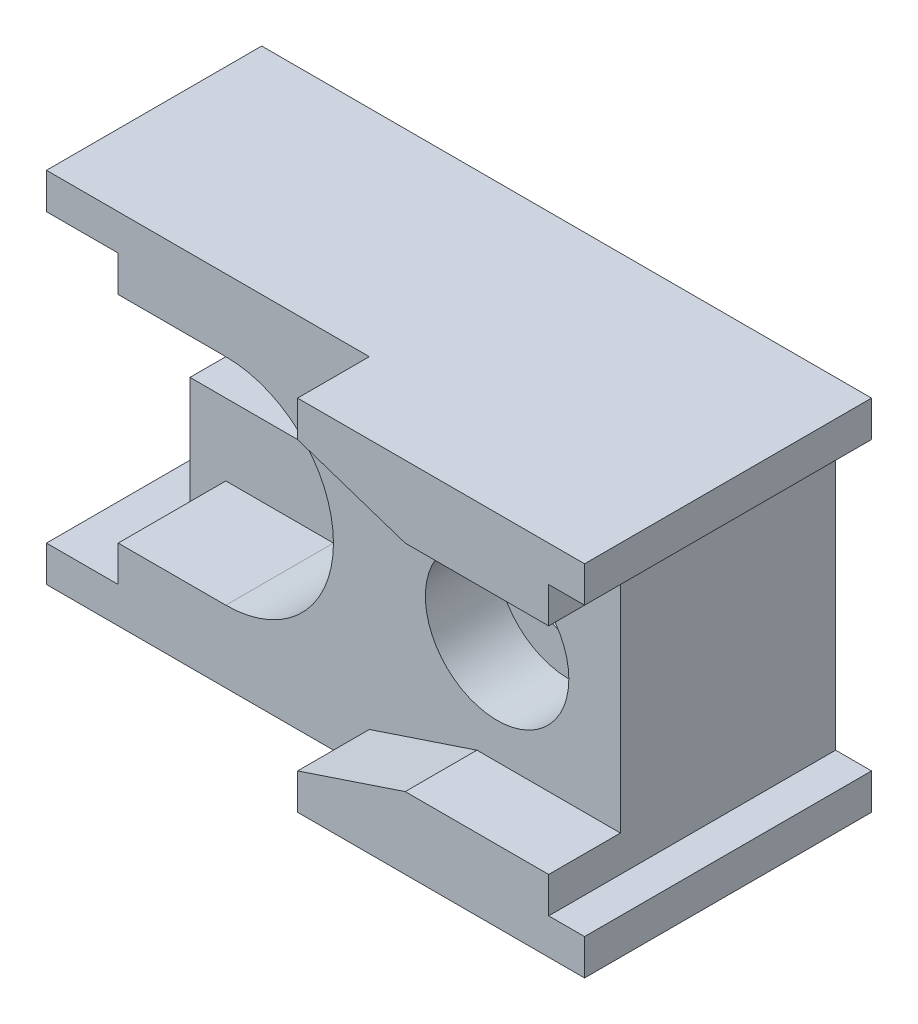
ISO-10303-21;
HEADER;
FILE_DESCRIPTION(('STEP AP214'),'2;1');
FILE_NAME('part.step','',(''),(''),'','','');
FILE_SCHEMA(('AUTOMOTIVE_DESIGN { 1 0 10303 214 1 1 1 1 }'));
ENDSEC;
DATA;
#1=APPLICATION_CONTEXT('core data for automotive mechanical design processes');
#2=APPLICATION_PROTOCOL_DEFINITION('international standard','automotive_design',2000,#1);
#3=PRODUCT_CONTEXT('',#1,'mechanical');
#4=PRODUCT('Part','Part','',(#3));
#5=PRODUCT_RELATED_PRODUCT_CATEGORY('part','',(#4));
#6=PRODUCT_DEFINITION_FORMATION('','',#4);
#7=PRODUCT_DEFINITION_CONTEXT('part definition',#1,'design');
#8=PRODUCT_DEFINITION('design','',#6,#7);
#9=PRODUCT_DEFINITION_SHAPE('','',#8);
#10=(LENGTH_UNIT() NAMED_UNIT(*) SI_UNIT(.MILLI.,.METRE.));
#11=(NAMED_UNIT(*) PLANE_ANGLE_UNIT() SI_UNIT($,.RADIAN.));
#12=(NAMED_UNIT(*) SI_UNIT($,.STERADIAN.) SOLID_ANGLE_UNIT());
#13=UNCERTAINTY_MEASURE_WITH_UNIT(LENGTH_MEASURE(1.E-05),#10,'distance_accuracy_value','');
#14=(GEOMETRIC_REPRESENTATION_CONTEXT(3) GLOBAL_UNCERTAINTY_ASSIGNED_CONTEXT((#13)) GLOBAL_UNIT_ASSIGNED_CONTEXT((#10,
#11,#12)) REPRESENTATION_CONTEXT('',''));
#15=CARTESIAN_POINT('',(0.,0.,0.));
#16=DIRECTION('',(0.,0.,1.));
#17=DIRECTION('',(1.,0.,0.));
#18=AXIS2_PLACEMENT_3D('',#15,#16,#17);
#19=CARTESIAN_POINT('',(-7.5,4.,8.));
#20=DIRECTION('',(1.,0.,0.));
#21=DIRECTION('',(0.,1.,0.));
#22=AXIS2_PLACEMENT_3D('',#19,#20,#21);
#23=PLANE('',#22);
#24=DIRECTION('',(0.,-1.,0.));
#25=VECTOR('',#24,1.);
#26=CARTESIAN_POINT('',(-7.5,0.,3.));
#27=LINE('',#26,#25);
#28=CARTESIAN_POINT('',(-7.5,4.,3.));
#29=VERTEX_POINT('',#28);
#30=CARTESIAN_POINT('',(-7.5,1.,3.));
#31=VERTEX_POINT('',#30);
#32=EDGE_CURVE('E260',#29,#31,#27,.T.);
#33=ORIENTED_EDGE('',*,*,#32,.F.);
#34=DIRECTION('',(0.,0.,-1.));
#35=VECTOR('',#34,1.);
#36=CARTESIAN_POINT('',(-7.5,4.,8.));
#37=LINE('',#36,#35);
#38=CARTESIAN_POINT('',(-7.5,4.,0.));
#39=VERTEX_POINT('',#38);
#40=EDGE_CURVE('E231',#29,#39,#37,.T.);
#41=ORIENTED_EDGE('',*,*,#40,.T.);
#42=DIRECTION('',(0.,-1.,0.));
#43=VECTOR('',#42,1.);
#44=CARTESIAN_POINT('',(-7.5,4.,0.));
#45=LINE('',#44,#43);
#46=CARTESIAN_POINT('',(-7.5,1.,0.));
#47=VERTEX_POINT('',#46);
#48=EDGE_CURVE('E176',#39,#47,#45,.T.);
#49=ORIENTED_EDGE('',*,*,#48,.T.);
#50=DIRECTION('',(0.,0.,-1.));
#51=VECTOR('',#50,1.);
#52=CARTESIAN_POINT('',(-7.5,1.,8.));
#53=LINE('',#52,#51);
#54=EDGE_CURVE('E229',#31,#47,#53,.T.);
#55=ORIENTED_EDGE('',*,*,#54,.F.);
#56=EDGE_LOOP('',(#33,#41,#49,#55));
#57=FACE_BOUND('',#56,.T.);
#58=ADVANCED_FACE('F33',(#57),#23,.F.);
#59=CARTESIAN_POINT('',(-7.5,1.,8.));
#60=DIRECTION('',(0.,1.,0.));
#61=DIRECTION('',(-1.,0.,0.));
#62=AXIS2_PLACEMENT_3D('',#59,#60,#61);
#63=PLANE('',#62);
#64=DIRECTION('',(1.,0.,0.));
#65=VECTOR('',#64,1.);
#66=CARTESIAN_POINT('',(-7.5,1.,3.));
#67=LINE('',#66,#65);
#68=CARTESIAN_POINT('',(-3.5,0.999999999999999,3.));
#69=VERTEX_POINT('',#68);
#70=EDGE_CURVE('E514',#31,#69,#67,.T.);
#71=ORIENTED_EDGE('',*,*,#70,.F.);
#72=ORIENTED_EDGE('',*,*,#54,.T.);
#73=DIRECTION('',(1.,0.,0.));
#74=VECTOR('',#73,1.);
#75=CARTESIAN_POINT('',(-7.5,1.,0.));
#76=LINE('',#75,#74);
#77=CARTESIAN_POINT('',(-3.5,0.999999999999999,0.));
#78=VERTEX_POINT('',#77);
#79=EDGE_CURVE('E179',#47,#78,#76,.T.);
#80=ORIENTED_EDGE('',*,*,#79,.T.);
#81=DIRECTION('',(0.,0.,-1.));
#82=VECTOR('',#81,1.);
#83=CARTESIAN_POINT('',(-3.5,0.999999999999999,8.));
#84=LINE('',#83,#82);
#85=EDGE_CURVE('E227',#69,#78,#84,.T.);
#86=ORIENTED_EDGE('',*,*,#85,.F.);
#87=EDGE_LOOP('',(#71,#72,#80,#86));
#88=FACE_BOUND('',#87,.T.);
#89=ADVANCED_FACE('F477',(#88),#63,.F.);
#90=CARTESIAN_POINT('',(-3.5,0.,8.));
#91=DIRECTION('',(0.,0.,-1.));
#92=DIRECTION('',(-1.,0.,0.));
#93=AXIS2_PLACEMENT_3D('',#90,#91,#92);
#94=CYLINDRICAL_SURFACE('',#93,0.999999999999999);
#95=CARTESIAN_POINT('',(-3.5,0.,3.));
#96=DIRECTION('',(0.,0.,1.));
#97=DIRECTION('',(1.,0.,0.));
#98=AXIS2_PLACEMENT_3D('',#95,#96,#97);
#99=CIRCLE('',#98,0.999999999999999);
#100=CARTESIAN_POINT('',(-3.5,-0.999999999999999,3.));
#101=VERTEX_POINT('',#100);
#102=EDGE_CURVE('E510',#69,#101,#99,.F.);
#103=ORIENTED_EDGE('',*,*,#102,.F.);
#104=ORIENTED_EDGE('',*,*,#85,.T.);
#105=CARTESIAN_POINT('',(-3.5,0.,0.));
#106=DIRECTION('',(0.,0.,-1.));
#107=DIRECTION('',(1.,0.,0.));
#108=AXIS2_PLACEMENT_3D('',#105,#106,#107);
#109=CIRCLE('',#108,0.999999999999999);
#110=CARTESIAN_POINT('',(-3.5,-0.999999999999999,0.));
#111=VERTEX_POINT('',#110);
#112=EDGE_CURVE('E182',#78,#111,#109,.T.);
#113=ORIENTED_EDGE('',*,*,#112,.T.);
#114=DIRECTION('',(0.,0.,-1.));
#115=VECTOR('',#114,1.);
#116=CARTESIAN_POINT('',(-3.5,-0.999999999999999,8.));
#117=LINE('',#116,#115);
#118=EDGE_CURVE('E225',#101,#111,#117,.T.);
#119=ORIENTED_EDGE('',*,*,#118,.F.);
#120=EDGE_LOOP('',(#103,#104,#113,#119));
#121=FACE_BOUND('',#120,.T.);
#122=ADVANCED_FACE('F482',(#121),#94,.F.);
#123=CARTESIAN_POINT('',(-7.5,-1.,8.));
#124=DIRECTION('',(0.,-1.,0.));
#125=DIRECTION('',(1.,0.,0.));
#126=AXIS2_PLACEMENT_3D('',#123,#124,#125);
#127=PLANE('',#126);
#128=DIRECTION('',(-1.,0.,0.));
#129=VECTOR('',#128,1.);
#130=CARTESIAN_POINT('',(-7.5,-1.,3.));
#131=LINE('',#130,#129);
#132=CARTESIAN_POINT('',(-7.5,-1.,3.));
#133=VERTEX_POINT('',#132);
#134=EDGE_CURVE('E515',#101,#133,#131,.T.);
#135=ORIENTED_EDGE('',*,*,#134,.F.);
#136=ORIENTED_EDGE('',*,*,#118,.T.);
#137=DIRECTION('',(-1.,0.,0.));
#138=VECTOR('',#137,1.);
#139=CARTESIAN_POINT('',(-7.5,-1.,0.));
#140=LINE('',#139,#138);
#141=CARTESIAN_POINT('',(-7.5,-1.,0.));
#142=VERTEX_POINT('',#141);
#143=EDGE_CURVE('E185',#111,#142,#140,.T.);
#144=ORIENTED_EDGE('',*,*,#143,.T.);
#145=DIRECTION('',(0.,0.,-1.));
#146=VECTOR('',#145,1.);
#147=CARTESIAN_POINT('',(-7.5,-1.,8.));
#148=LINE('',#147,#146);
#149=EDGE_CURVE('E223',#133,#142,#148,.T.);
#150=ORIENTED_EDGE('',*,*,#149,.F.);
#151=EDGE_LOOP('',(#135,#136,#144,#150));
#152=FACE_BOUND('',#151,.T.);
#153=ADVANCED_FACE('F494',(#152),#127,.F.);
#154=CARTESIAN_POINT('',(-7.5,-1.,8.));
#155=DIRECTION('',(1.,0.,0.));
#156=DIRECTION('',(0.,0.,-1.));
#157=AXIS2_PLACEMENT_3D('',#154,#155,#156);
#158=PLANE('',#157);
#159=DIRECTION('',(0.,-1.,0.));
#160=VECTOR('',#159,1.);
#161=CARTESIAN_POINT('',(-7.5,0.,3.));
#162=LINE('',#161,#160);
#163=CARTESIAN_POINT('',(-7.5,-4.,3.));
#164=VERTEX_POINT('',#163);
#165=EDGE_CURVE('E740',#133,#164,#162,.T.);
#166=ORIENTED_EDGE('',*,*,#165,.F.);
#167=ORIENTED_EDGE('',*,*,#149,.T.);
#168=DIRECTION('',(0.,-1.,0.));
#169=VECTOR('',#168,1.);
#170=CARTESIAN_POINT('',(-7.5,-1.,0.));
#171=LINE('',#170,#169);
#172=CARTESIAN_POINT('',(-7.5,-4.,0.));
#173=VERTEX_POINT('',#172);
#174=EDGE_CURVE('E188',#142,#173,#171,.T.);
#175=ORIENTED_EDGE('',*,*,#174,.T.);
#176=DIRECTION('',(0.,0.,-1.));
#177=VECTOR('',#176,1.);
#178=CARTESIAN_POINT('',(-7.5,-4.,8.));
#179=LINE('',#178,#177);
#180=EDGE_CURVE('E221',#164,#173,#179,.T.);
#181=ORIENTED_EDGE('',*,*,#180,.F.);
#182=EDGE_LOOP('',(#166,#167,#175,#181));
#183=FACE_BOUND('',#182,.T.);
#184=ADVANCED_FACE('F490',(#183),#158,.F.);
#185=CARTESIAN_POINT('',(-8.5,4.,8.));
#186=DIRECTION('',(1.,0.,0.));
#187=DIRECTION('',(0.,0.,-1.));
#188=AXIS2_PLACEMENT_3D('',#185,#186,#187);
#189=PLANE('',#188);
#190=DIRECTION('',(0.,-1.,0.));
#191=VECTOR('',#190,1.);
#192=CARTESIAN_POINT('',(-8.5,0.,6.));
#193=LINE('',#192,#191);
#194=CARTESIAN_POINT('',(-8.5,5.,6.));
#195=VERTEX_POINT('',#194);
#196=CARTESIAN_POINT('',(-8.5,4.,6.));
#197=VERTEX_POINT('',#196);
#198=EDGE_CURVE('E433',#195,#197,#193,.T.);
#199=ORIENTED_EDGE('',*,*,#198,.F.);
#200=DIRECTION('',(0.,0.,-1.));
#201=VECTOR('',#200,1.);
#202=CARTESIAN_POINT('',(-8.5,5.,8.));
#203=LINE('',#202,#201);
#204=CARTESIAN_POINT('',(-8.5,5.,0.));
#205=VERTEX_POINT('',#204);
#206=EDGE_CURVE('E11',#195,#205,#203,.T.);
#207=ORIENTED_EDGE('',*,*,#206,.T.);
#208=DIRECTION('',(0.,-1.,0.));
#209=VECTOR('',#208,1.);
#210=CARTESIAN_POINT('',(-8.5,4.,0.));
#211=LINE('',#210,#209);
#212=CARTESIAN_POINT('',(-8.5,4.,0.));
#213=VERTEX_POINT('',#212);
#214=EDGE_CURVE('E169',#205,#213,#211,.T.);
#215=ORIENTED_EDGE('',*,*,#214,.T.);
#216=DIRECTION('',(0.,0.,-1.));
#217=VECTOR('',#216,1.);
#218=CARTESIAN_POINT('',(-8.5,4.,8.));
#219=LINE('',#218,#217);
#220=EDGE_CURVE('E42',#197,#213,#219,.T.);
#221=ORIENTED_EDGE('',*,*,#220,.F.);
#222=EDGE_LOOP('',(#199,#207,#215,#221));
#223=FACE_BOUND('',#222,.T.);
#224=ADVANCED_FACE('F247',(#223),#189,.F.);
#225=CARTESIAN_POINT('',(-8.5,4.,8.));
#226=DIRECTION('',(0.,1.,0.));
#227=DIRECTION('',(0.,0.,1.));
#228=AXIS2_PLACEMENT_3D('',#225,#226,#227);
#229=PLANE('',#228);
#230=DIRECTION('',(1.,0.,0.));
#231=VECTOR('',#230,1.);
#232=CARTESIAN_POINT('',(0.,4.,6.));
#233=LINE('',#232,#231);
#234=CARTESIAN_POINT('',(-6.5,4.,6.));
#235=VERTEX_POINT('',#234);
#236=EDGE_CURVE('E243',#197,#235,#233,.T.);
#237=ORIENTED_EDGE('',*,*,#236,.F.);
#238=ORIENTED_EDGE('',*,*,#220,.T.);
#239=DIRECTION('',(1.,0.,0.));
#240=VECTOR('',#239,1.);
#241=CARTESIAN_POINT('',(-8.5,4.,0.));
#242=LINE('',#241,#240);
#243=EDGE_CURVE('E173',#213,#39,#242,.T.);
#244=ORIENTED_EDGE('',*,*,#243,.T.);
#245=ORIENTED_EDGE('',*,*,#40,.F.);
#246=DIRECTION('',(-1.,0.,0.));
#247=VECTOR('',#246,1.);
#248=CARTESIAN_POINT('',(0.,4.,3.));
#249=LINE('',#248,#247);
#250=CARTESIAN_POINT('',(-6.5,4.,3.));
#251=VERTEX_POINT('',#250);
#252=EDGE_CURVE('E264',#251,#29,#249,.T.);
#253=ORIENTED_EDGE('',*,*,#252,.F.);
#254=DIRECTION('',(0.,0.,1.));
#255=VECTOR('',#254,1.);
#256=CARTESIAN_POINT('',(-6.5,4.,3.));
#257=LINE('',#256,#255);
#258=EDGE_CURVE('E523',#251,#235,#257,.T.);
#259=ORIENTED_EDGE('',*,*,#258,.T.);
#260=EDGE_LOOP('',(#237,#238,#244,#245,#253,#259));
#261=FACE_BOUND('',#260,.T.);
#262=ADVANCED_FACE('F236',(#261),#229,.F.);
#263=CARTESIAN_POINT('',(-8.5,-4.,8.));
#264=DIRECTION('',(0.,-1.,0.));
#265=DIRECTION('',(0.,0.,-1.));
#266=AXIS2_PLACEMENT_3D('',#263,#264,#265);
#267=PLANE('',#266);
#268=DIRECTION('',(-1.,0.,0.));
#269=VECTOR('',#268,1.);
#270=CARTESIAN_POINT('',(0.,-4.,6.));
#271=LINE('',#270,#269);
#272=CARTESIAN_POINT('',(-6.5,-4.,6.));
#273=VERTEX_POINT('',#272);
#274=CARTESIAN_POINT('',(-8.5,-4.,6.));
#275=VERTEX_POINT('',#274);
#276=EDGE_CURVE('E436',#273,#275,#271,.T.);
#277=ORIENTED_EDGE('',*,*,#276,.F.);
#278=DIRECTION('',(0.,0.,1.));
#279=VECTOR('',#278,1.);
#280=CARTESIAN_POINT('',(-6.5,-4.,3.));
#281=LINE('',#280,#279);
#282=CARTESIAN_POINT('',(-6.5,-4.,3.));
#283=VERTEX_POINT('',#282);
#284=EDGE_CURVE('E528',#283,#273,#281,.T.);
#285=ORIENTED_EDGE('',*,*,#284,.F.);
#286=DIRECTION('',(1.,0.,0.));
#287=VECTOR('',#286,1.);
#288=CARTESIAN_POINT('',(0.,-4.,3.));
#289=LINE('',#288,#287);
#290=EDGE_CURVE('E762',#164,#283,#289,.T.);
#291=ORIENTED_EDGE('',*,*,#290,.F.);
#292=ORIENTED_EDGE('',*,*,#180,.T.);
#293=DIRECTION('',(-1.,0.,0.));
#294=VECTOR('',#293,1.);
#295=CARTESIAN_POINT('',(-8.5,-4.,0.));
#296=LINE('',#295,#294);
#297=CARTESIAN_POINT('',(-8.5,-4.,0.));
#298=VERTEX_POINT('',#297);
#299=EDGE_CURVE('E191',#173,#298,#296,.T.);
#300=ORIENTED_EDGE('',*,*,#299,.T.);
#301=DIRECTION('',(0.,0.,-1.));
#302=VECTOR('',#301,1.);
#303=CARTESIAN_POINT('',(-8.5,-4.,8.));
#304=LINE('',#303,#302);
#305=EDGE_CURVE('E219',#275,#298,#304,.T.);
#306=ORIENTED_EDGE('',*,*,#305,.F.);
#307=EDGE_LOOP('',(#277,#285,#291,#292,#300,#306));
#308=FACE_BOUND('',#307,.T.);
#309=ADVANCED_FACE('F488',(#308),#267,.F.);
#310=CARTESIAN_POINT('',(-8.5,-5.,8.));
#311=DIRECTION('',(1.,0.,0.));
#312=DIRECTION('',(0.,0.,-1.));
#313=AXIS2_PLACEMENT_3D('',#310,#311,#312);
#314=PLANE('',#313);
#315=DIRECTION('',(0.,-1.,0.));
#316=VECTOR('',#315,1.);
#317=CARTESIAN_POINT('',(-8.5,0.,6.));
#318=LINE('',#317,#316);
#319=CARTESIAN_POINT('',(-8.5,-5.,6.));
#320=VERTEX_POINT('',#319);
#321=EDGE_CURVE('E438',#275,#320,#318,.T.);
#322=ORIENTED_EDGE('',*,*,#321,.F.);
#323=ORIENTED_EDGE('',*,*,#305,.T.);
#324=DIRECTION('',(0.,-1.,0.));
#325=VECTOR('',#324,1.);
#326=CARTESIAN_POINT('',(-8.5,-5.,0.));
#327=LINE('',#326,#325);
#328=CARTESIAN_POINT('',(-8.5,-5.,0.));
#329=VERTEX_POINT('',#328);
#330=EDGE_CURVE('E194',#298,#329,#327,.T.);
#331=ORIENTED_EDGE('',*,*,#330,.T.);
#332=DIRECTION('',(0.,0.,-1.));
#333=VECTOR('',#332,1.);
#334=CARTESIAN_POINT('',(-8.5,-5.,8.));
#335=LINE('',#334,#333);
#336=EDGE_CURVE('E217',#320,#329,#335,.T.);
#337=ORIENTED_EDGE('',*,*,#336,.F.);
#338=EDGE_LOOP('',(#322,#323,#331,#337));
#339=FACE_BOUND('',#338,.T.);
#340=ADVANCED_FACE('F644',(#339),#314,.F.);
#341=CARTESIAN_POINT('',(-8.5,-5.,8.));
#342=DIRECTION('',(0.,1.,0.));
#343=DIRECTION('',(0.,0.,1.));
#344=AXIS2_PLACEMENT_3D('',#341,#342,#343);
#345=PLANE('',#344);
#346=DIRECTION('',(0.,0.,1.));
#347=VECTOR('',#346,1.);
#348=CARTESIAN_POINT('',(0.500000000000001,-5.,6.));
#349=LINE('',#348,#347);
#350=CARTESIAN_POINT('',(0.500000000000001,-5.,6.));
#351=VERTEX_POINT('',#350);
#352=CARTESIAN_POINT('',(0.500000000000001,-5.,8.));
#353=VERTEX_POINT('',#352);
#354=EDGE_CURVE('E389',#351,#353,#349,.T.);
#355=ORIENTED_EDGE('',*,*,#354,.F.);
#356=DIRECTION('',(1.,0.,0.));
#357=VECTOR('',#356,1.);
#358=CARTESIAN_POINT('',(0.,-5.,6.));
#359=LINE('',#358,#357);
#360=EDGE_CURVE('E440',#320,#351,#359,.T.);
#361=ORIENTED_EDGE('',*,*,#360,.F.);
#362=ORIENTED_EDGE('',*,*,#336,.T.);
#363=DIRECTION('',(1.,0.,0.));
#364=VECTOR('',#363,1.);
#365=CARTESIAN_POINT('',(-8.5,-5.,0.));
#366=LINE('',#365,#364);
#367=CARTESIAN_POINT('',(8.5,-5.,0.));
#368=VERTEX_POINT('',#367);
#369=EDGE_CURVE('E197',#329,#368,#366,.T.);
#370=ORIENTED_EDGE('',*,*,#369,.T.);
#371=DIRECTION('',(0.,0.,-1.));
#372=VECTOR('',#371,1.);
#373=CARTESIAN_POINT('',(8.5,-5.,8.));
#374=LINE('',#373,#372);
#375=CARTESIAN_POINT('',(8.5,-5.,8.));
#376=VERTEX_POINT('',#375);
#377=EDGE_CURVE('E214',#376,#368,#374,.T.);
#378=ORIENTED_EDGE('',*,*,#377,.F.);
#379=DIRECTION('',(1.,0.,0.));
#380=VECTOR('',#379,1.);
#381=CARTESIAN_POINT('',(-8.5,-5.,8.));
#382=LINE('',#381,#380);
#383=EDGE_CURVE('E123',#353,#376,#382,.T.);
#384=ORIENTED_EDGE('',*,*,#383,.F.);
#385=EDGE_LOOP('',(#355,#361,#362,#370,#378,#384));
#386=FACE_BOUND('',#385,.T.);
#387=ADVANCED_FACE('F450',(#386),#345,.F.);
#388=CARTESIAN_POINT('',(7.5,4.,8.));
#389=DIRECTION('',(-1.,0.,0.));
#390=DIRECTION('',(0.,-1.,0.));
#391=AXIS2_PLACEMENT_3D('',#388,#389,#390);
#392=PLANE('',#391);
#393=DIRECTION('',(0.,0.,1.));
#394=VECTOR('',#393,1.);
#395=CARTESIAN_POINT('',(7.5,-3.,6.));
#396=LINE('',#395,#394);
#397=CARTESIAN_POINT('',(7.5,-3.,6.));
#398=VERTEX_POINT('',#397);
#399=CARTESIAN_POINT('',(7.5,-3.,8.));
#400=VERTEX_POINT('',#399);
#401=EDGE_CURVE('E399',#398,#400,#396,.T.);
#402=ORIENTED_EDGE('',*,*,#401,.T.);
#403=DIRECTION('',(0.,1.,0.));
#404=VECTOR('',#403,1.);
#405=CARTESIAN_POINT('',(7.5,4.,8.));
#406=LINE('',#405,#404);
#407=CARTESIAN_POINT('',(7.5,-4.,8.));
#408=VERTEX_POINT('',#407);
#409=EDGE_CURVE('E144',#408,#400,#406,.T.);
#410=ORIENTED_EDGE('',*,*,#409,.F.);
#411=DIRECTION('',(0.,0.,-1.));
#412=VECTOR('',#411,1.);
#413=CARTESIAN_POINT('',(7.5,-4.,8.));
#414=LINE('',#413,#412);
#415=CARTESIAN_POINT('',(7.5,-4.,0.));
#416=VERTEX_POINT('',#415);
#417=EDGE_CURVE('E156',#408,#416,#414,.T.);
#418=ORIENTED_EDGE('',*,*,#417,.T.);
#419=DIRECTION('',(0.,1.,0.));
#420=VECTOR('',#419,1.);
#421=CARTESIAN_POINT('',(7.5,4.,0.));
#422=LINE('',#421,#420);
#423=CARTESIAN_POINT('',(7.5,4.,0.));
#424=VERTEX_POINT('',#423);
#425=EDGE_CURVE('E153',#416,#424,#422,.T.);
#426=ORIENTED_EDGE('',*,*,#425,.T.);
#427=DIRECTION('',(0.,0.,-1.));
#428=VECTOR('',#427,1.);
#429=CARTESIAN_POINT('',(7.5,4.,8.));
#430=LINE('',#429,#428);
#431=CARTESIAN_POINT('',(7.5,4.,8.));
#432=VERTEX_POINT('',#431);
#433=EDGE_CURVE('E148',#432,#424,#430,.T.);
#434=ORIENTED_EDGE('',*,*,#433,.F.);
#435=CARTESIAN_POINT('',(7.5,3.,8.));
#436=VERTEX_POINT('',#435);
#437=EDGE_CURVE('E134',#436,#432,#406,.T.);
#438=ORIENTED_EDGE('',*,*,#437,.F.);
#439=DIRECTION('',(0.,0.,1.));
#440=VECTOR('',#439,1.);
#441=CARTESIAN_POINT('',(7.5,3.,6.));
#442=LINE('',#441,#440);
#443=CARTESIAN_POINT('',(7.5,3.,6.));
#444=VERTEX_POINT('',#443);
#445=EDGE_CURVE('E49',#444,#436,#442,.T.);
#446=ORIENTED_EDGE('',*,*,#445,.F.);
#447=DIRECTION('',(0.,1.,0.));
#448=VECTOR('',#447,1.);
#449=CARTESIAN_POINT('',(7.5,0.,6.));
#450=LINE('',#449,#448);
#451=EDGE_CURVE('E413',#398,#444,#450,.T.);
#452=ORIENTED_EDGE('',*,*,#451,.F.);
#453=EDGE_LOOP('',(#402,#410,#418,#426,#434,#438,#446,#452));
#454=FACE_BOUND('',#453,.T.);
#455=ADVANCED_FACE('F150',(#454),#392,.F.);
#456=CARTESIAN_POINT('',(-3.5,0.,8.));
#457=DIRECTION('',(0.,0.,1.));
#458=DIRECTION('',(1.,0.,0.));
#459=AXIS2_PLACEMENT_3D('',#456,#457,#458);
#460=PLANE('',#459);
#461=ORIENTED_EDGE('',*,*,#409,.T.);
#462=DIRECTION('',(-1.,0.,0.));
#463=VECTOR('',#462,1.);
#464=CARTESIAN_POINT('',(0.,-3.,8.));
#465=LINE('',#464,#463);
#466=CARTESIAN_POINT('',(3.5,-3.,8.));
#467=VERTEX_POINT('',#466);
#468=EDGE_CURVE('E367',#400,#467,#465,.T.);
#469=ORIENTED_EDGE('',*,*,#468,.T.);
#470=DIRECTION('',(-0.948683298050514,-0.316227766016838,0.));
#471=VECTOR('',#470,1.);
#472=CARTESIAN_POINT('',(1.25,-3.75,8.));
#473=LINE('',#472,#471);
#474=CARTESIAN_POINT('',(0.500000000000001,-4.,8.));
#475=VERTEX_POINT('',#474);
#476=EDGE_CURVE('E357',#467,#475,#473,.T.);
#477=ORIENTED_EDGE('',*,*,#476,.T.);
#478=DIRECTION('',(0.,-1.,0.));
#479=VECTOR('',#478,1.);
#480=CARTESIAN_POINT('',(0.500000000000001,0.,8.));
#481=LINE('',#480,#479);
#482=EDGE_CURVE('E362',#475,#353,#481,.T.);
#483=ORIENTED_EDGE('',*,*,#482,.T.);
#484=ORIENTED_EDGE('',*,*,#383,.T.);
#485=DIRECTION('',(0.,1.,0.));
#486=VECTOR('',#485,1.);
#487=CARTESIAN_POINT('',(8.5,-5.,8.));
#488=LINE('',#487,#486);
#489=CARTESIAN_POINT('',(8.5,-4.,8.));
#490=VERTEX_POINT('',#489);
#491=EDGE_CURVE('E403',#376,#490,#488,.T.);
#492=ORIENTED_EDGE('',*,*,#491,.T.);
#493=DIRECTION('',(-1.,0.,0.));
#494=VECTOR('',#493,1.);
#495=CARTESIAN_POINT('',(8.5,-4.,8.));
#496=LINE('',#495,#494);
#497=EDGE_CURVE('E145',#490,#408,#496,.T.);
#498=ORIENTED_EDGE('',*,*,#497,.T.);
#499=EDGE_LOOP('',(#461,#469,#477,#483,#484,#492,#498));
#500=FACE_BOUND('',#499,.T.);
#501=ADVANCED_FACE('F370',(#500),#460,.T.);
#502=CARTESIAN_POINT('',(-8.5,5.,8.));
#503=DIRECTION('',(0.,-1.,0.));
#504=DIRECTION('',(0.,0.,-1.));
#505=AXIS2_PLACEMENT_3D('',#502,#503,#504);
#506=PLANE('',#505);
#507=DIRECTION('',(-1.,0.,0.));
#508=VECTOR('',#507,1.);
#509=CARTESIAN_POINT('',(0.,5.,6.));
#510=LINE('',#509,#508);
#511=CARTESIAN_POINT('',(0.500000000000001,5.,6.));
#512=VERTEX_POINT('',#511);
#513=EDGE_CURVE('E431',#512,#195,#510,.T.);
#514=ORIENTED_EDGE('',*,*,#513,.F.);
#515=DIRECTION('',(0.,0.,1.));
#516=VECTOR('',#515,1.);
#517=CARTESIAN_POINT('',(0.500000000000001,5.,6.));
#518=LINE('',#517,#516);
#519=CARTESIAN_POINT('',(0.500000000000001,5.,8.));
#520=VERTEX_POINT('',#519);
#521=EDGE_CURVE('E391',#512,#520,#518,.T.);
#522=ORIENTED_EDGE('',*,*,#521,.T.);
#523=DIRECTION('',(-1.,0.,0.));
#524=VECTOR('',#523,1.);
#525=CARTESIAN_POINT('',(-8.5,5.,8.));
#526=LINE('',#525,#524);
#527=CARTESIAN_POINT('',(8.5,5.,8.));
#528=VERTEX_POINT('',#527);
#529=EDGE_CURVE('E207',#528,#520,#526,.T.);
#530=ORIENTED_EDGE('',*,*,#529,.F.);
#531=DIRECTION('',(0.,0.,-1.));
#532=VECTOR('',#531,1.);
#533=CARTESIAN_POINT('',(8.5,5.,8.));
#534=LINE('',#533,#532);
#535=CARTESIAN_POINT('',(8.5,5.,0.));
#536=VERTEX_POINT('',#535);
#537=EDGE_CURVE('E161',#528,#536,#534,.T.);
#538=ORIENTED_EDGE('',*,*,#537,.T.);
#539=DIRECTION('',(-1.,0.,0.));
#540=VECTOR('',#539,1.);
#541=CARTESIAN_POINT('',(-8.5,5.,0.));
#542=LINE('',#541,#540);
#543=EDGE_CURVE('E166',#536,#205,#542,.T.);
#544=ORIENTED_EDGE('',*,*,#543,.T.);
#545=ORIENTED_EDGE('',*,*,#206,.F.);
#546=EDGE_LOOP('',(#514,#522,#530,#538,#544,#545));
#547=FACE_BOUND('',#546,.T.);
#548=ADVANCED_FACE('F35',(#547),#506,.F.);
#549=CARTESIAN_POINT('',(8.5,-5.,8.));
#550=DIRECTION('',(-1.,0.,0.));
#551=DIRECTION('',(0.,-1.,0.));
#552=AXIS2_PLACEMENT_3D('',#549,#550,#551);
#553=PLANE('',#552);
#554=DIRECTION('',(0.,1.,0.));
#555=VECTOR('',#554,1.);
#556=CARTESIAN_POINT('',(8.5,-5.,0.));
#557=LINE('',#556,#555);
#558=CARTESIAN_POINT('',(8.5,-4.,0.));
#559=VERTEX_POINT('',#558);
#560=EDGE_CURVE('E199',#368,#559,#557,.T.);
#561=ORIENTED_EDGE('',*,*,#560,.T.);
#562=DIRECTION('',(0.,0.,-1.));
#563=VECTOR('',#562,1.);
#564=CARTESIAN_POINT('',(8.5,-4.,8.));
#565=LINE('',#564,#563);
#566=EDGE_CURVE('E211',#490,#559,#565,.T.);
#567=ORIENTED_EDGE('',*,*,#566,.F.);
#568=ORIENTED_EDGE('',*,*,#491,.F.);
#569=ORIENTED_EDGE('',*,*,#377,.T.);
#570=EDGE_LOOP('',(#561,#567,#568,#569));
#571=FACE_BOUND('',#570,.T.);
#572=ADVANCED_FACE('F454',(#571),#553,.F.);
#573=CARTESIAN_POINT('',(8.5,-4.,8.));
#574=DIRECTION('',(0.,-1.,0.));
#575=DIRECTION('',(1.,0.,0.));
#576=AXIS2_PLACEMENT_3D('',#573,#574,#575);
#577=PLANE('',#576);
#578=DIRECTION('',(-1.,0.,0.));
#579=VECTOR('',#578,1.);
#580=CARTESIAN_POINT('',(8.5,-4.,0.));
#581=LINE('',#580,#579);
#582=EDGE_CURVE('E201',#559,#416,#581,.T.);
#583=ORIENTED_EDGE('',*,*,#582,.T.);
#584=ORIENTED_EDGE('',*,*,#417,.F.);
#585=ORIENTED_EDGE('',*,*,#497,.F.);
#586=ORIENTED_EDGE('',*,*,#566,.T.);
#587=EDGE_LOOP('',(#583,#584,#585,#586));
#588=FACE_BOUND('',#587,.T.);
#589=ADVANCED_FACE('F409',(#588),#577,.F.);
#590=CARTESIAN_POINT('',(8.5,4.,8.));
#591=DIRECTION('',(0.,1.,0.));
#592=DIRECTION('',(0.,0.,1.));
#593=AXIS2_PLACEMENT_3D('',#590,#591,#592);
#594=PLANE('',#593);
#595=DIRECTION('',(1.,0.,0.));
#596=VECTOR('',#595,1.);
#597=CARTESIAN_POINT('',(8.5,4.,0.));
#598=LINE('',#597,#596);
#599=CARTESIAN_POINT('',(8.5,4.,0.));
#600=VERTEX_POINT('',#599);
#601=EDGE_CURVE('E204',#424,#600,#598,.T.);
#602=ORIENTED_EDGE('',*,*,#601,.T.);
#603=DIRECTION('',(0.,0.,-1.));
#604=VECTOR('',#603,1.);
#605=CARTESIAN_POINT('',(8.5,4.,8.));
#606=LINE('',#605,#604);
#607=CARTESIAN_POINT('',(8.5,4.,8.));
#608=VERTEX_POINT('',#607);
#609=EDGE_CURVE('E157',#608,#600,#606,.T.);
#610=ORIENTED_EDGE('',*,*,#609,.F.);
#611=DIRECTION('',(1.,0.,0.));
#612=VECTOR('',#611,1.);
#613=CARTESIAN_POINT('',(8.5,4.,8.));
#614=LINE('',#613,#612);
#615=EDGE_CURVE('E139',#432,#608,#614,.T.);
#616=ORIENTED_EDGE('',*,*,#615,.F.);
#617=ORIENTED_EDGE('',*,*,#433,.T.);
#618=EDGE_LOOP('',(#602,#610,#616,#617));
#619=FACE_BOUND('',#618,.T.);
#620=ADVANCED_FACE('F159',(#619),#594,.F.);
#621=CARTESIAN_POINT('',(8.5,4.,8.));
#622=DIRECTION('',(-1.,0.,0.));
#623=DIRECTION('',(0.,0.,1.));
#624=AXIS2_PLACEMENT_3D('',#621,#622,#623);
#625=PLANE('',#624);
#626=DIRECTION('',(0.,1.,0.));
#627=VECTOR('',#626,1.);
#628=CARTESIAN_POINT('',(8.5,4.,0.));
#629=LINE('',#628,#627);
#630=EDGE_CURVE('E114',#600,#536,#629,.T.);
#631=ORIENTED_EDGE('',*,*,#630,.T.);
#632=ORIENTED_EDGE('',*,*,#537,.F.);
#633=DIRECTION('',(0.,1.,0.));
#634=VECTOR('',#633,1.);
#635=CARTESIAN_POINT('',(8.5,4.,8.));
#636=LINE('',#635,#634);
#637=EDGE_CURVE('E58',#608,#528,#636,.T.);
#638=ORIENTED_EDGE('',*,*,#637,.F.);
#639=ORIENTED_EDGE('',*,*,#609,.T.);
#640=EDGE_LOOP('',(#631,#632,#638,#639));
#641=FACE_BOUND('',#640,.T.);
#642=ADVANCED_FACE('F455',(#641),#625,.F.);
#643=DIRECTION('',(0.,1.,0.));
#644=VECTOR('',#643,1.);
#645=CARTESIAN_POINT('',(0.500000000000001,0.,8.));
#646=LINE('',#645,#644);
#647=CARTESIAN_POINT('',(0.500000000000001,4.,8.));
#648=VERTEX_POINT('',#647);
#649=EDGE_CURVE('E385',#648,#520,#646,.T.);
#650=ORIENTED_EDGE('',*,*,#649,.F.);
#651=DIRECTION('',(-0.948683298050514,0.316227766016838,0.));
#652=VECTOR('',#651,1.);
#653=CARTESIAN_POINT('',(1.25,3.75,8.));
#654=LINE('',#653,#652);
#655=CARTESIAN_POINT('',(3.5,3.,8.));
#656=VERTEX_POINT('',#655);
#657=EDGE_CURVE('E374',#656,#648,#654,.T.);
#658=ORIENTED_EDGE('',*,*,#657,.F.);
#659=DIRECTION('',(-1.,0.,0.));
#660=VECTOR('',#659,1.);
#661=CARTESIAN_POINT('',(0.,3.,8.));
#662=LINE('',#661,#660);
#663=EDGE_CURVE('E142',#436,#656,#662,.T.);
#664=ORIENTED_EDGE('',*,*,#663,.F.);
#665=ORIENTED_EDGE('',*,*,#437,.T.);
#666=ORIENTED_EDGE('',*,*,#615,.T.);
#667=ORIENTED_EDGE('',*,*,#637,.T.);
#668=ORIENTED_EDGE('',*,*,#529,.T.);
#669=EDGE_LOOP('',(#650,#658,#664,#665,#666,#667,#668));
#670=FACE_BOUND('',#669,.T.);
#671=ADVANCED_FACE('F137',(#670),#460,.T.);
#672=CARTESIAN_POINT('',(-3.5,0.,0.));
#673=DIRECTION('',(0.,0.,1.));
#674=DIRECTION('',(1.,0.,0.));
#675=AXIS2_PLACEMENT_3D('',#672,#673,#674);
#676=PLANE('',#675);
#677=CARTESIAN_POINT('',(4.06200040100656,0.,0.));
#678=DIRECTION('',(0.,0.,1.));
#679=DIRECTION('',(1.,0.,0.));
#680=AXIS2_PLACEMENT_3D('',#677,#678,#679);
#681=CIRCLE('',#680,1.);
#682=CARTESIAN_POINT('',(5.06200040100656,0.,0.));
#683=VERTEX_POINT('',#682);
#684=EDGE_CURVE('E37',#683,#683,#681,.T.);
#685=ORIENTED_EDGE('',*,*,#684,.T.);
#686=EDGE_LOOP('',(#685));
#687=FACE_BOUND('',#686,.T.);
#688=ORIENTED_EDGE('',*,*,#543,.F.);
#689=ORIENTED_EDGE('',*,*,#630,.F.);
#690=ORIENTED_EDGE('',*,*,#601,.F.);
#691=ORIENTED_EDGE('',*,*,#425,.F.);
#692=ORIENTED_EDGE('',*,*,#582,.F.);
#693=ORIENTED_EDGE('',*,*,#560,.F.);
#694=ORIENTED_EDGE('',*,*,#369,.F.);
#695=ORIENTED_EDGE('',*,*,#330,.F.);
#696=ORIENTED_EDGE('',*,*,#299,.F.);
#697=ORIENTED_EDGE('',*,*,#174,.F.);
#698=ORIENTED_EDGE('',*,*,#143,.F.);
#699=ORIENTED_EDGE('',*,*,#112,.F.);
#700=ORIENTED_EDGE('',*,*,#79,.F.);
#701=ORIENTED_EDGE('',*,*,#48,.F.);
#702=ORIENTED_EDGE('',*,*,#243,.F.);
#703=ORIENTED_EDGE('',*,*,#214,.F.);
#704=EDGE_LOOP('',(#688,#689,#690,#691,#692,#693,#694,#695,#696,#697,#698,#699,#700,#701,#702,#703));
#705=FACE_BOUND('',#704,.T.);
#706=ADVANCED_FACE('F251',(#687,#705),#676,.F.);
#707=CARTESIAN_POINT('',(0.,-3.,6.));
#708=DIRECTION('',(0.,1.,0.));
#709=DIRECTION('',(-1.,0.,0.));
#710=AXIS2_PLACEMENT_3D('',#707,#708,#709);
#711=PLANE('',#710);
#712=ORIENTED_EDGE('',*,*,#468,.F.);
#713=ORIENTED_EDGE('',*,*,#401,.F.);
#714=DIRECTION('',(-1.,0.,0.));
#715=VECTOR('',#714,1.);
#716=CARTESIAN_POINT('',(0.,-3.,6.));
#717=LINE('',#716,#715);
#718=CARTESIAN_POINT('',(3.5,-3.,6.));
#719=VERTEX_POINT('',#718);
#720=EDGE_CURVE('E361',#398,#719,#717,.T.);
#721=ORIENTED_EDGE('',*,*,#720,.T.);
#722=DIRECTION('',(0.,0.,1.));
#723=VECTOR('',#722,1.);
#724=CARTESIAN_POINT('',(3.5,-3.,6.));
#725=LINE('',#724,#723);
#726=EDGE_CURVE('E170',#719,#467,#725,.T.);
#727=ORIENTED_EDGE('',*,*,#726,.T.);
#728=EDGE_LOOP('',(#712,#713,#721,#727));
#729=FACE_BOUND('',#728,.T.);
#730=ADVANCED_FACE('F366',(#729),#711,.T.);
#731=CARTESIAN_POINT('',(1.25,-3.75,6.));
#732=DIRECTION('',(-0.316227766016838,0.948683298050514,0.));
#733=DIRECTION('',(-0.948683298050514,-0.316227766016838,0.));
#734=AXIS2_PLACEMENT_3D('',#731,#732,#733);
#735=PLANE('',#734);
#736=ORIENTED_EDGE('',*,*,#476,.F.);
#737=ORIENTED_EDGE('',*,*,#726,.F.);
#738=DIRECTION('',(-0.948683298050514,-0.316227766016838,0.));
#739=VECTOR('',#738,1.);
#740=CARTESIAN_POINT('',(1.25,-3.75,6.));
#741=LINE('',#740,#739);
#742=CARTESIAN_POINT('',(0.500000000000001,-4.,6.));
#743=VERTEX_POINT('',#742);
#744=EDGE_CURVE('E380',#719,#743,#741,.T.);
#745=ORIENTED_EDGE('',*,*,#744,.T.);
#746=DIRECTION('',(0.,0.,1.));
#747=VECTOR('',#746,1.);
#748=CARTESIAN_POINT('',(0.500000000000001,-4.,6.));
#749=LINE('',#748,#747);
#750=EDGE_CURVE('E353',#743,#475,#749,.T.);
#751=ORIENTED_EDGE('',*,*,#750,.T.);
#752=EDGE_LOOP('',(#736,#737,#745,#751));
#753=FACE_BOUND('',#752,.T.);
#754=ADVANCED_FACE('F359',(#753),#735,.T.);
#755=CARTESIAN_POINT('',(0.500000000000001,0.,6.));
#756=DIRECTION('',(-1.,0.,0.));
#757=DIRECTION('',(0.,0.,1.));
#758=AXIS2_PLACEMENT_3D('',#755,#756,#757);
#759=PLANE('',#758);
#760=ORIENTED_EDGE('',*,*,#482,.F.);
#761=ORIENTED_EDGE('',*,*,#750,.F.);
#762=DIRECTION('',(0.,-1.,0.));
#763=VECTOR('',#762,1.);
#764=CARTESIAN_POINT('',(0.500000000000001,0.,6.));
#765=LINE('',#764,#763);
#766=EDGE_CURVE('E442',#743,#351,#765,.T.);
#767=ORIENTED_EDGE('',*,*,#766,.T.);
#768=ORIENTED_EDGE('',*,*,#354,.T.);
#769=EDGE_LOOP('',(#760,#761,#767,#768));
#770=FACE_BOUND('',#769,.T.);
#771=ADVANCED_FACE('F444',(#770),#759,.T.);
#772=CARTESIAN_POINT('',(0.500000000000001,0.,6.));
#773=DIRECTION('',(1.,0.,0.));
#774=DIRECTION('',(0.,0.,-1.));
#775=AXIS2_PLACEMENT_3D('',#772,#773,#774);
#776=PLANE('',#775);
#777=ORIENTED_EDGE('',*,*,#649,.T.);
#778=ORIENTED_EDGE('',*,*,#521,.F.);
#779=DIRECTION('',(0.,1.,0.));
#780=VECTOR('',#779,1.);
#781=CARTESIAN_POINT('',(0.500000000000001,0.,6.));
#782=LINE('',#781,#780);
#783=CARTESIAN_POINT('',(0.500000000000001,4.,6.));
#784=VERTEX_POINT('',#783);
#785=EDGE_CURVE('E428',#784,#512,#782,.T.);
#786=ORIENTED_EDGE('',*,*,#785,.F.);
#787=DIRECTION('',(0.,0.,1.));
#788=VECTOR('',#787,1.);
#789=CARTESIAN_POINT('',(0.500000000000001,4.,6.));
#790=LINE('',#789,#788);
#791=EDGE_CURVE('E394',#784,#648,#790,.T.);
#792=ORIENTED_EDGE('',*,*,#791,.T.);
#793=EDGE_LOOP('',(#777,#778,#786,#792));
#794=FACE_BOUND('',#793,.T.);
#795=ADVANCED_FACE('F460',(#794),#776,.F.);
#796=CARTESIAN_POINT('',(1.25,3.75,6.));
#797=DIRECTION('',(0.316227766016838,0.948683298050514,0.));
#798=DIRECTION('',(-0.948683298050514,0.316227766016838,0.));
#799=AXIS2_PLACEMENT_3D('',#796,#797,#798);
#800=PLANE('',#799);
#801=ORIENTED_EDGE('',*,*,#657,.T.);
#802=ORIENTED_EDGE('',*,*,#791,.F.);
#803=DIRECTION('',(-0.948683298050514,0.316227766016838,0.));
#804=VECTOR('',#803,1.);
#805=CARTESIAN_POINT('',(1.25,3.75,6.));
#806=LINE('',#805,#804);
#807=CARTESIAN_POINT('',(3.5,3.,6.));
#808=VERTEX_POINT('',#807);
#809=EDGE_CURVE('E425',#808,#784,#806,.T.);
#810=ORIENTED_EDGE('',*,*,#809,.F.);
#811=DIRECTION('',(0.,0.,1.));
#812=VECTOR('',#811,1.);
#813=CARTESIAN_POINT('',(3.5,3.,6.));
#814=LINE('',#813,#812);
#815=EDGE_CURVE('E396',#808,#656,#814,.T.);
#816=ORIENTED_EDGE('',*,*,#815,.T.);
#817=EDGE_LOOP('',(#801,#802,#810,#816));
#818=FACE_BOUND('',#817,.T.);
#819=ADVANCED_FACE('F464',(#818),#800,.F.);
#820=CARTESIAN_POINT('',(0.,3.,6.));
#821=DIRECTION('',(0.,1.,0.));
#822=DIRECTION('',(-1.,0.,0.));
#823=AXIS2_PLACEMENT_3D('',#820,#821,#822);
#824=PLANE('',#823);
#825=ORIENTED_EDGE('',*,*,#663,.T.);
#826=ORIENTED_EDGE('',*,*,#815,.F.);
#827=DIRECTION('',(-1.,0.,0.));
#828=VECTOR('',#827,1.);
#829=CARTESIAN_POINT('',(0.,3.,6.));
#830=LINE('',#829,#828);
#831=EDGE_CURVE('E420',#444,#808,#830,.T.);
#832=ORIENTED_EDGE('',*,*,#831,.F.);
#833=ORIENTED_EDGE('',*,*,#445,.T.);
#834=EDGE_LOOP('',(#825,#826,#832,#833));
#835=FACE_BOUND('',#834,.T.);
#836=ADVANCED_FACE('F465',(#835),#824,.F.);
#837=CARTESIAN_POINT('',(0.,0.,6.));
#838=DIRECTION('',(0.,0.,1.));
#839=DIRECTION('',(1.,0.,0.));
#840=AXIS2_PLACEMENT_3D('',#837,#838,#839);
#841=PLANE('',#840);
#842=ORIENTED_EDGE('',*,*,#236,.T.);
#843=DIRECTION('',(0.,1.,0.));
#844=VECTOR('',#843,1.);
#845=CARTESIAN_POINT('',(-6.5,0.,6.));
#846=LINE('',#845,#844);
#847=CARTESIAN_POINT('',(-6.5,3.,6.));
#848=VERTEX_POINT('',#847);
#849=EDGE_CURVE('E738',#848,#235,#846,.T.);
#850=ORIENTED_EDGE('',*,*,#849,.F.);
#851=DIRECTION('',(1.,0.,0.));
#852=VECTOR('',#851,1.);
#853=CARTESIAN_POINT('',(0.,3.,6.));
#854=LINE('',#853,#852);
#855=CARTESIAN_POINT('',(-3.5,3.,6.));
#856=VERTEX_POINT('',#855);
#857=EDGE_CURVE('E733',#848,#856,#854,.T.);
#858=ORIENTED_EDGE('',*,*,#857,.T.);
#859=CARTESIAN_POINT('',(-3.5,0.,6.));
#860=DIRECTION('',(0.,0.,1.));
#861=DIRECTION('',(1.,0.,0.));
#862=AXIS2_PLACEMENT_3D('',#859,#860,#861);
#863=CIRCLE('',#862,3.);
#864=CARTESIAN_POINT('',(-3.5,-3.,6.));
#865=VERTEX_POINT('',#864);
#866=EDGE_CURVE('E730',#865,#856,#863,.T.);
#867=ORIENTED_EDGE('',*,*,#866,.F.);
#868=DIRECTION('',(1.,0.,0.));
#869=VECTOR('',#868,1.);
#870=CARTESIAN_POINT('',(0.,-3.,6.));
#871=LINE('',#870,#869);
#872=CARTESIAN_POINT('',(-6.5,-3.,6.));
#873=VERTEX_POINT('',#872);
#874=EDGE_CURVE('E724',#873,#865,#871,.T.);
#875=ORIENTED_EDGE('',*,*,#874,.F.);
#876=DIRECTION('',(0.,-1.,0.));
#877=VECTOR('',#876,1.);
#878=CARTESIAN_POINT('',(-6.5,0.,6.));
#879=LINE('',#878,#877);
#880=EDGE_CURVE('E717',#873,#273,#879,.T.);
#881=ORIENTED_EDGE('',*,*,#880,.T.);
#882=ORIENTED_EDGE('',*,*,#276,.T.);
#883=ORIENTED_EDGE('',*,*,#321,.T.);
#884=ORIENTED_EDGE('',*,*,#360,.T.);
#885=ORIENTED_EDGE('',*,*,#766,.F.);
#886=ORIENTED_EDGE('',*,*,#744,.F.);
#887=ORIENTED_EDGE('',*,*,#720,.F.);
#888=ORIENTED_EDGE('',*,*,#451,.T.);
#889=ORIENTED_EDGE('',*,*,#831,.T.);
#890=ORIENTED_EDGE('',*,*,#809,.T.);
#891=ORIENTED_EDGE('',*,*,#785,.T.);
#892=ORIENTED_EDGE('',*,*,#513,.T.);
#893=ORIENTED_EDGE('',*,*,#198,.T.);
#894=EDGE_LOOP('',(#842,#850,#858,#867,#875,#881,#882,#883,#884,#885,#886,#887,#888,#889,#890,
#891,#892,#893));
#895=FACE_BOUND('',#894,.T.);
#896=CARTESIAN_POINT('',(4.06200040100656,0.,6.));
#897=DIRECTION('',(0.,0.,1.));
#898=DIRECTION('',(1.,0.,0.));
#899=AXIS2_PLACEMENT_3D('',#896,#897,#898);
#900=CIRCLE('',#899,2.);
#901=CARTESIAN_POINT('',(6.06200040100656,0.,6.));
#902=VERTEX_POINT('',#901);
#903=EDGE_CURVE('E377',#902,#902,#900,.T.);
#904=ORIENTED_EDGE('',*,*,#903,.F.);
#905=EDGE_LOOP('',(#904));
#906=FACE_BOUND('',#905,.T.);
#907=ADVANCED_FACE('F415',(#895,#906),#841,.T.);
#908=CARTESIAN_POINT('',(4.06200040100656,0.,4.));
#909=DIRECTION('',(0.,0.,1.));
#910=DIRECTION('',(1.,0.,0.));
#911=AXIS2_PLACEMENT_3D('',#908,#909,#910);
#912=CYLINDRICAL_SURFACE('',#911,2.);
#913=CARTESIAN_POINT('',(4.06200040100656,0.,4.));
#914=DIRECTION('',(0.,0.,1.));
#915=DIRECTION('',(1.,0.,0.));
#916=AXIS2_PLACEMENT_3D('',#913,#914,#915);
#917=CIRCLE('',#916,2.);
#918=CARTESIAN_POINT('',(6.06200040100656,0.,4.));
#919=VERTEX_POINT('',#918);
#920=EDGE_CURVE('E372',#919,#919,#917,.T.);
#921=ORIENTED_EDGE('',*,*,#920,.F.);
#922=EDGE_LOOP('',(#921));
#923=FACE_BOUND('',#922,.T.);
#924=ORIENTED_EDGE('',*,*,#903,.T.);
#925=EDGE_LOOP('',(#924));
#926=FACE_BOUND('',#925,.T.);
#927=ADVANCED_FACE('F472',(#923,#926),#912,.F.);
#928=CARTESIAN_POINT('',(4.06200040100656,0.,4.));
#929=DIRECTION('',(0.,0.,1.));
#930=DIRECTION('',(1.,0.,0.));
#931=AXIS2_PLACEMENT_3D('',#928,#929,#930);
#932=PLANE('',#931);
#933=CARTESIAN_POINT('',(4.06200040100656,0.,4.));
#934=DIRECTION('',(0.,0.,1.));
#935=DIRECTION('',(1.,0.,0.));
#936=AXIS2_PLACEMENT_3D('',#933,#934,#935);
#937=CIRCLE('',#936,1.);
#938=CARTESIAN_POINT('',(5.06200040100656,0.,4.));
#939=VERTEX_POINT('',#938);
#940=EDGE_CURVE('E532',#939,#939,#937,.T.);
#941=ORIENTED_EDGE('',*,*,#940,.F.);
#942=EDGE_LOOP('',(#941));
#943=FACE_BOUND('',#942,.T.);
#944=ORIENTED_EDGE('',*,*,#920,.T.);
#945=EDGE_LOOP('',(#944));
#946=FACE_BOUND('',#945,.T.);
#947=ADVANCED_FACE('F543',(#943,#946),#932,.T.);
#948=CARTESIAN_POINT('',(4.06200040100656,0.,-18.));
#949=DIRECTION('',(0.,0.,1.));
#950=DIRECTION('',(1.,0.,0.));
#951=AXIS2_PLACEMENT_3D('',#948,#949,#950);
#952=CYLINDRICAL_SURFACE('',#951,1.);
#953=ORIENTED_EDGE('',*,*,#940,.T.);
#954=EDGE_LOOP('',(#953));
#955=FACE_BOUND('',#954,.T.);
#956=ORIENTED_EDGE('',*,*,#684,.F.);
#957=EDGE_LOOP('',(#956));
#958=FACE_BOUND('',#957,.T.);
#959=ADVANCED_FACE('F549',(#955,#958),#952,.F.);
#960=CARTESIAN_POINT('',(0.,0.,3.));
#961=DIRECTION('',(0.,0.,1.));
#962=DIRECTION('',(1.,0.,0.));
#963=AXIS2_PLACEMENT_3D('',#960,#961,#962);
#964=PLANE('',#963);
#965=ORIENTED_EDGE('',*,*,#32,.T.);
#966=ORIENTED_EDGE('',*,*,#70,.T.);
#967=ORIENTED_EDGE('',*,*,#102,.T.);
#968=ORIENTED_EDGE('',*,*,#134,.T.);
#969=ORIENTED_EDGE('',*,*,#165,.T.);
#970=ORIENTED_EDGE('',*,*,#290,.T.);
#971=DIRECTION('',(0.,-1.,0.));
#972=VECTOR('',#971,1.);
#973=CARTESIAN_POINT('',(-6.5,0.,3.));
#974=LINE('',#973,#972);
#975=CARTESIAN_POINT('',(-6.5,-3.,3.));
#976=VERTEX_POINT('',#975);
#977=EDGE_CURVE('E760',#976,#283,#974,.T.);
#978=ORIENTED_EDGE('',*,*,#977,.F.);
#979=DIRECTION('',(1.,0.,0.));
#980=VECTOR('',#979,1.);
#981=CARTESIAN_POINT('',(0.,-3.,3.));
#982=LINE('',#981,#980);
#983=CARTESIAN_POINT('',(-3.5,-3.,3.));
#984=VERTEX_POINT('',#983);
#985=EDGE_CURVE('E757',#976,#984,#982,.T.);
#986=ORIENTED_EDGE('',*,*,#985,.T.);
#987=CARTESIAN_POINT('',(-3.5,0.,3.));
#988=DIRECTION('',(0.,0.,1.));
#989=DIRECTION('',(1.,0.,0.));
#990=AXIS2_PLACEMENT_3D('',#987,#988,#989);
#991=CIRCLE('',#990,3.);
#992=CARTESIAN_POINT('',(-3.5,3.,3.));
#993=VERTEX_POINT('',#992);
#994=EDGE_CURVE('E754',#984,#993,#991,.T.);
#995=ORIENTED_EDGE('',*,*,#994,.T.);
#996=DIRECTION('',(1.,0.,0.));
#997=VECTOR('',#996,1.);
#998=CARTESIAN_POINT('',(0.,3.,3.));
#999=LINE('',#998,#997);
#1000=CARTESIAN_POINT('',(-6.5,3.,3.));
#1001=VERTEX_POINT('',#1000);
#1002=EDGE_CURVE('E751',#1001,#993,#999,.T.);
#1003=ORIENTED_EDGE('',*,*,#1002,.F.);
#1004=DIRECTION('',(0.,1.,0.));
#1005=VECTOR('',#1004,1.);
#1006=CARTESIAN_POINT('',(-6.5,0.,3.));
#1007=LINE('',#1006,#1005);
#1008=EDGE_CURVE('E747',#1001,#251,#1007,.T.);
#1009=ORIENTED_EDGE('',*,*,#1008,.T.);
#1010=ORIENTED_EDGE('',*,*,#252,.T.);
#1011=EDGE_LOOP('',(#965,#966,#967,#968,#969,#970,#978,#986,#995,#1003,#1009,#1010));
#1012=FACE_BOUND('',#1011,.T.);
#1013=ADVANCED_FACE('F603',(#1012),#964,.T.);
#1014=CARTESIAN_POINT('',(-6.5,0.,3.));
#1015=DIRECTION('',(1.,0.,0.));
#1016=DIRECTION('',(0.,0.,-1.));
#1017=AXIS2_PLACEMENT_3D('',#1014,#1015,#1016);
#1018=PLANE('',#1017);
#1019=ORIENTED_EDGE('',*,*,#849,.T.);
#1020=ORIENTED_EDGE('',*,*,#258,.F.);
#1021=ORIENTED_EDGE('',*,*,#1008,.F.);
#1022=DIRECTION('',(0.,0.,1.));
#1023=VECTOR('',#1022,1.);
#1024=CARTESIAN_POINT('',(-6.5,3.,3.));
#1025=LINE('',#1024,#1023);
#1026=EDGE_CURVE('E525',#1001,#848,#1025,.T.);
#1027=ORIENTED_EDGE('',*,*,#1026,.T.);
#1028=EDGE_LOOP('',(#1019,#1020,#1021,#1027));
#1029=FACE_BOUND('',#1028,.T.);
#1030=ADVANCED_FACE('F660',(#1029),#1018,.F.);
#1031=CARTESIAN_POINT('',(0.,3.,3.));
#1032=DIRECTION('',(0.,-1.,0.));
#1033=DIRECTION('',(0.,0.,-1.));
#1034=AXIS2_PLACEMENT_3D('',#1031,#1032,#1033);
#1035=PLANE('',#1034);
#1036=ORIENTED_EDGE('',*,*,#857,.F.);
#1037=ORIENTED_EDGE('',*,*,#1026,.F.);
#1038=ORIENTED_EDGE('',*,*,#1002,.T.);
#1039=DIRECTION('',(0.,0.,1.));
#1040=VECTOR('',#1039,1.);
#1041=CARTESIAN_POINT('',(-3.5,3.,3.));
#1042=LINE('',#1041,#1040);
#1043=EDGE_CURVE('E743',#993,#856,#1042,.T.);
#1044=ORIENTED_EDGE('',*,*,#1043,.T.);
#1045=EDGE_LOOP('',(#1036,#1037,#1038,#1044));
#1046=FACE_BOUND('',#1045,.T.);
#1047=ADVANCED_FACE('F669',(#1046),#1035,.T.);
#1048=CARTESIAN_POINT('',(-3.5,0.,3.));
#1049=DIRECTION('',(0.,0.,1.));
#1050=DIRECTION('',(1.,0.,0.));
#1051=AXIS2_PLACEMENT_3D('',#1048,#1049,#1050);
#1052=CYLINDRICAL_SURFACE('',#1051,3.);
#1053=ORIENTED_EDGE('',*,*,#866,.T.);
#1054=ORIENTED_EDGE('',*,*,#1043,.F.);
#1055=ORIENTED_EDGE('',*,*,#994,.F.);
#1056=DIRECTION('',(0.,0.,1.));
#1057=VECTOR('',#1056,1.);
#1058=CARTESIAN_POINT('',(-3.5,-3.,3.));
#1059=LINE('',#1058,#1057);
#1060=EDGE_CURVE('E745',#984,#865,#1059,.T.);
#1061=ORIENTED_EDGE('',*,*,#1060,.T.);
#1062=EDGE_LOOP('',(#1053,#1054,#1055,#1061));
#1063=FACE_BOUND('',#1062,.T.);
#1064=ADVANCED_FACE('F679',(#1063),#1052,.F.);
#1065=CARTESIAN_POINT('',(0.,-3.,3.));
#1066=DIRECTION('',(0.,-1.,0.));
#1067=DIRECTION('',(0.,0.,-1.));
#1068=AXIS2_PLACEMENT_3D('',#1065,#1066,#1067);
#1069=PLANE('',#1068);
#1070=ORIENTED_EDGE('',*,*,#874,.T.);
#1071=ORIENTED_EDGE('',*,*,#1060,.F.);
#1072=ORIENTED_EDGE('',*,*,#985,.F.);
#1073=DIRECTION('',(0.,0.,1.));
#1074=VECTOR('',#1073,1.);
#1075=CARTESIAN_POINT('',(-6.5,-3.,3.));
#1076=LINE('',#1075,#1074);
#1077=EDGE_CURVE('E721',#976,#873,#1076,.T.);
#1078=ORIENTED_EDGE('',*,*,#1077,.T.);
#1079=EDGE_LOOP('',(#1070,#1071,#1072,#1078));
#1080=FACE_BOUND('',#1079,.T.);
#1081=ADVANCED_FACE('F689',(#1080),#1069,.F.);
#1082=CARTESIAN_POINT('',(-6.5,0.,3.));
#1083=DIRECTION('',(-1.,0.,0.));
#1084=DIRECTION('',(0.,-1.,0.));
#1085=AXIS2_PLACEMENT_3D('',#1082,#1083,#1084);
#1086=PLANE('',#1085);
#1087=ORIENTED_EDGE('',*,*,#880,.F.);
#1088=ORIENTED_EDGE('',*,*,#1077,.F.);
#1089=ORIENTED_EDGE('',*,*,#977,.T.);
#1090=ORIENTED_EDGE('',*,*,#284,.T.);
#1091=EDGE_LOOP('',(#1087,#1088,#1089,#1090));
#1092=FACE_BOUND('',#1091,.T.);
#1093=ADVANCED_FACE('F699',(#1092),#1086,.T.);
#1094=CLOSED_SHELL('',(#58,#89,#122,#153,#184,#224,#262,#309,#340,#387,#455,#501,#548,#572,#589,
#620,#642,#671,#706,#730,#754,#771,#795,#819,#836,#907,#927,#947,#959,#1013,#1030,#1047,#1064,
#1081,#1093));
#1095=MANIFOLD_SOLID_BREP('B2',#1094);
#1096=ADVANCED_BREP_SHAPE_REPRESENTATION('',(#18,#1095),#14);
#1097=SHAPE_DEFINITION_REPRESENTATION(#9,#1096);
ENDSEC;
END-ISO-10303-21;
